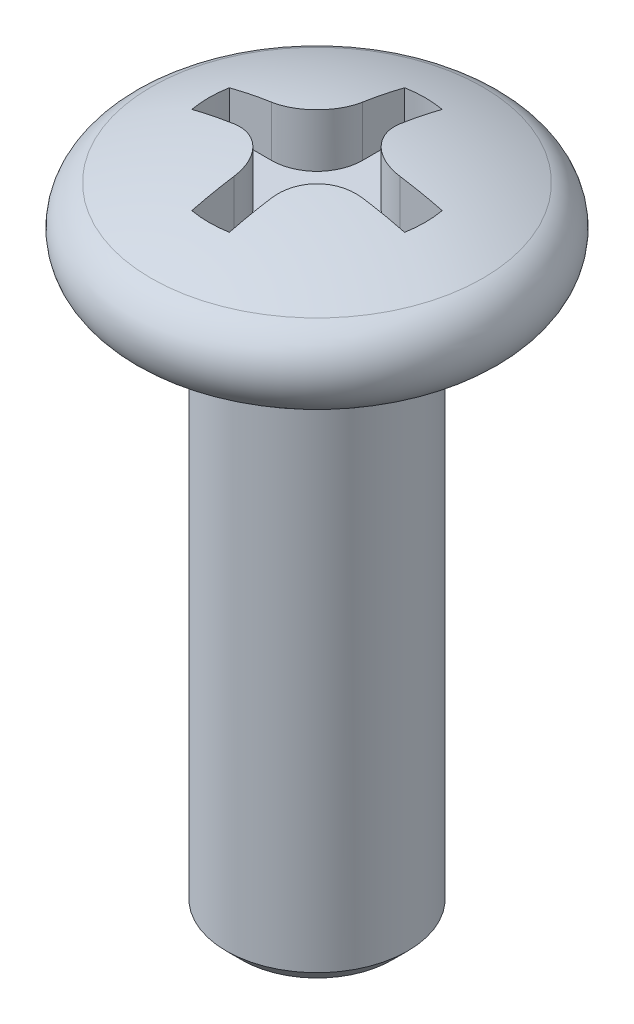
ISO-10303-21;
HEADER;
FILE_DESCRIPTION(('STEP AP214'),'2;1');
FILE_NAME('part.step','',(''),(''),'','','');
FILE_SCHEMA(('AUTOMOTIVE_DESIGN { 1 0 10303 214 1 1 1 1 }'));
ENDSEC;
DATA;
#1=APPLICATION_CONTEXT('core data for automotive mechanical design processes');
#2=APPLICATION_PROTOCOL_DEFINITION('international standard','automotive_design',2000,#1);
#3=PRODUCT_CONTEXT('',#1,'mechanical');
#4=PRODUCT('Part','Part','',(#3));
#5=PRODUCT_RELATED_PRODUCT_CATEGORY('part','',(#4));
#6=PRODUCT_DEFINITION_FORMATION('','',#4);
#7=PRODUCT_DEFINITION_CONTEXT('part definition',#1,'design');
#8=PRODUCT_DEFINITION('design','',#6,#7);
#9=PRODUCT_DEFINITION_SHAPE('','',#8);
#10=(LENGTH_UNIT() NAMED_UNIT(*) SI_UNIT(.MILLI.,.METRE.));
#11=(NAMED_UNIT(*) PLANE_ANGLE_UNIT() SI_UNIT($,.RADIAN.));
#12=(NAMED_UNIT(*) SI_UNIT($,.STERADIAN.) SOLID_ANGLE_UNIT());
#13=UNCERTAINTY_MEASURE_WITH_UNIT(LENGTH_MEASURE(1.E-05),#10,'distance_accuracy_value','');
#14=(GEOMETRIC_REPRESENTATION_CONTEXT(3) GLOBAL_UNCERTAINTY_ASSIGNED_CONTEXT((#13)) GLOBAL_UNIT_ASSIGNED_CONTEXT((#10,
#11,#12)) REPRESENTATION_CONTEXT('',''));
#15=CARTESIAN_POINT('',(0.,0.,0.));
#16=DIRECTION('',(0.,0.,1.));
#17=DIRECTION('',(1.,0.,0.));
#18=AXIS2_PLACEMENT_3D('',#15,#16,#17);
#19=CARTESIAN_POINT('',(0.,0.8,0.));
#20=DIRECTION('',(0.,-1.,0.));
#21=DIRECTION('',(0.,0.,-1.));
#22=AXIS2_PLACEMENT_3D('',#19,#20,#21);
#23=PLANE('',#22);
#24=DIRECTION('',(0.,0.,1.));
#25=VECTOR('',#24,1.);
#26=CARTESIAN_POINT('',(-0.2692388155425,0.8,1.526437178598));
#27=LINE('',#26,#25);
#28=CARTESIAN_POINT('',(-0.2692388155425,0.8,0.9192388155425));
#29=VERTEX_POINT('',#28);
#30=CARTESIAN_POINT('',(-0.2692388155425,0.8,1.52643717859784));
#31=VERTEX_POINT('',#30);
#32=EDGE_CURVE('E159',#29,#31,#27,.T.);
#33=ORIENTED_EDGE('',*,*,#32,.T.);
#34=CARTESIAN_POINT('',(0.,0.8,0.));
#35=DIRECTION('',(0.,-1.,0.));
#36=DIRECTION('',(0.,0.,-1.));
#37=AXIS2_PLACEMENT_3D('',#34,#35,#36);
#38=CIRCLE('',#37,1.55);
#39=CARTESIAN_POINT('',(0.269238815542473,0.8,1.52643717859769));
#40=VERTEX_POINT('',#39);
#41=EDGE_CURVE('E231',#31,#40,#38,.F.);
#42=ORIENTED_EDGE('',*,*,#41,.T.);
#43=DIRECTION('',(0.,0.,-1.));
#44=VECTOR('',#43,1.);
#45=CARTESIAN_POINT('',(0.2692388155425,0.8,0.9192388155425));
#46=LINE('',#45,#44);
#47=CARTESIAN_POINT('',(0.2692388155425,0.8,0.9192388155425));
#48=VERTEX_POINT('',#47);
#49=EDGE_CURVE('E163',#40,#48,#46,.T.);
#50=ORIENTED_EDGE('',*,*,#49,.T.);
#51=CARTESIAN_POINT('',(0.9192388155425,0.8,0.9192388155425));
#52=DIRECTION('',(0.,-1.,0.));
#53=DIRECTION('',(0.,0.,-1.));
#54=AXIS2_PLACEMENT_3D('',#51,#52,#53);
#55=CIRCLE('',#54,0.65);
#56=CARTESIAN_POINT('',(0.9192388155425,0.8,0.2692388155425));
#57=VERTEX_POINT('',#56);
#58=EDGE_CURVE('E166',#57,#48,#55,.F.);
#59=ORIENTED_EDGE('',*,*,#58,.F.);
#60=DIRECTION('',(1.,0.,0.));
#61=VECTOR('',#60,1.);
#62=CARTESIAN_POINT('',(1.526437178598,0.8,0.2692388155425));
#63=LINE('',#62,#61);
#64=CARTESIAN_POINT('',(1.52643717859784,0.8,0.2692388155425));
#65=VERTEX_POINT('',#64);
#66=EDGE_CURVE('E167',#57,#65,#63,.T.);
#67=ORIENTED_EDGE('',*,*,#66,.T.);
#68=CARTESIAN_POINT('',(0.,0.8,0.));
#69=DIRECTION('',(0.,-1.,0.));
#70=DIRECTION('',(0.,0.,-1.));
#71=AXIS2_PLACEMENT_3D('',#68,#69,#70);
#72=CIRCLE('',#71,1.55);
#73=CARTESIAN_POINT('',(1.52643717859769,0.8,-0.269238815542473));
#74=VERTEX_POINT('',#73);
#75=EDGE_CURVE('E242',#65,#74,#72,.F.);
#76=ORIENTED_EDGE('',*,*,#75,.T.);
#77=DIRECTION('',(-1.,0.,0.));
#78=VECTOR('',#77,1.);
#79=CARTESIAN_POINT('',(0.9192388155425,0.8,-0.2692388155425));
#80=LINE('',#79,#78);
#81=CARTESIAN_POINT('',(0.9192388155425,0.8,-0.2692388155425));
#82=VERTEX_POINT('',#81);
#83=EDGE_CURVE('E171',#74,#82,#80,.T.);
#84=ORIENTED_EDGE('',*,*,#83,.T.);
#85=CARTESIAN_POINT('',(0.9192388155425,0.8,-0.9192388155425));
#86=DIRECTION('',(0.,-1.,0.));
#87=DIRECTION('',(0.,0.,-1.));
#88=AXIS2_PLACEMENT_3D('',#85,#86,#87);
#89=CIRCLE('',#88,0.65);
#90=CARTESIAN_POINT('',(0.2692388155425,0.8,-0.9192388155425));
#91=VERTEX_POINT('',#90);
#92=EDGE_CURVE('E174',#91,#82,#89,.F.);
#93=ORIENTED_EDGE('',*,*,#92,.F.);
#94=DIRECTION('',(0.,0.,-1.));
#95=VECTOR('',#94,1.);
#96=CARTESIAN_POINT('',(0.2692388155425,0.8,-1.526437178598));
#97=LINE('',#96,#95);
#98=CARTESIAN_POINT('',(0.2692388155425,0.8,-1.52643717859784));
#99=VERTEX_POINT('',#98);
#100=EDGE_CURVE('E176',#91,#99,#97,.T.);
#101=ORIENTED_EDGE('',*,*,#100,.T.);
#102=CARTESIAN_POINT('',(0.,0.8,0.));
#103=DIRECTION('',(0.,-1.,0.));
#104=DIRECTION('',(0.,0.,-1.));
#105=AXIS2_PLACEMENT_3D('',#102,#103,#104);
#106=CIRCLE('',#105,1.55);
#107=CARTESIAN_POINT('',(-0.269238815542474,0.8,-1.52643717859769));
#108=VERTEX_POINT('',#107);
#109=EDGE_CURVE('E135',#99,#108,#106,.F.);
#110=ORIENTED_EDGE('',*,*,#109,.T.);
#111=DIRECTION('',(0.,0.,1.));
#112=VECTOR('',#111,1.);
#113=CARTESIAN_POINT('',(-0.2692388155425,0.8,-0.9192388155425));
#114=LINE('',#113,#112);
#115=CARTESIAN_POINT('',(-0.2692388155425,0.8,-0.9192388155425));
#116=VERTEX_POINT('',#115);
#117=EDGE_CURVE('E131',#108,#116,#114,.T.);
#118=ORIENTED_EDGE('',*,*,#117,.T.);
#119=CARTESIAN_POINT('',(-0.9192388155425,0.8,-0.9192388155425));
#120=DIRECTION('',(0.,-1.,0.));
#121=DIRECTION('',(0.,0.,-1.));
#122=AXIS2_PLACEMENT_3D('',#119,#120,#121);
#123=CIRCLE('',#122,0.65);
#124=CARTESIAN_POINT('',(-0.9192388155425,0.8,-0.2692388155425));
#125=VERTEX_POINT('',#124);
#126=EDGE_CURVE('E19',#125,#116,#123,.F.);
#127=ORIENTED_EDGE('',*,*,#126,.F.);
#128=DIRECTION('',(-1.,0.,0.));
#129=VECTOR('',#128,1.);
#130=CARTESIAN_POINT('',(-1.526437178598,0.8,-0.2692388155425));
#131=LINE('',#130,#129);
#132=CARTESIAN_POINT('',(-1.52643717859769,0.8,-0.269238815542473));
#133=VERTEX_POINT('',#132);
#134=EDGE_CURVE('E126',#125,#133,#131,.T.);
#135=ORIENTED_EDGE('',*,*,#134,.T.);
#136=CARTESIAN_POINT('',(0.,0.8,0.));
#137=DIRECTION('',(0.,-1.,0.));
#138=DIRECTION('',(0.,0.,-1.));
#139=AXIS2_PLACEMENT_3D('',#136,#137,#138);
#140=CIRCLE('',#139,1.55);
#141=CARTESIAN_POINT('',(-1.52643717859784,0.8,0.2692388155425));
#142=VERTEX_POINT('',#141);
#143=EDGE_CURVE('E239',#133,#142,#140,.F.);
#144=ORIENTED_EDGE('',*,*,#143,.T.);
#145=DIRECTION('',(1.,0.,0.));
#146=VECTOR('',#145,1.);
#147=CARTESIAN_POINT('',(-0.9192388155425,0.8,0.2692388155425));
#148=LINE('',#147,#146);
#149=CARTESIAN_POINT('',(-0.9192388155425,0.8,0.2692388155425));
#150=VERTEX_POINT('',#149);
#151=EDGE_CURVE('E156',#142,#150,#148,.T.);
#152=ORIENTED_EDGE('',*,*,#151,.T.);
#153=CARTESIAN_POINT('',(-0.9192388155425,0.8,0.9192388155425));
#154=DIRECTION('',(0.,-1.,0.));
#155=DIRECTION('',(0.,0.,-1.));
#156=AXIS2_PLACEMENT_3D('',#153,#154,#155);
#157=CIRCLE('',#156,0.65);
#158=EDGE_CURVE('E225',#29,#150,#157,.F.);
#159=ORIENTED_EDGE('',*,*,#158,.F.);
#160=EDGE_LOOP('',(#33,#42,#50,#59,#67,#76,#84,#93,#101,#110,#118,#127,#135,#144,#152,#159));
#161=FACE_BOUND('',#160,.T.);
#162=ADVANCED_FACE('F16',(#161),#23,.F.);
#163=CARTESIAN_POINT('',(-1.526437178598,0.8,-0.2692388155425));
#164=DIRECTION('',(0.,0.,-1.));
#165=DIRECTION('',(-1.,0.,0.));
#166=AXIS2_PLACEMENT_3D('',#163,#164,#165);
#167=PLANE('',#166);
#168=ORIENTED_EDGE('',*,*,#134,.F.);
#169=DIRECTION('',(0.,-1.,0.));
#170=VECTOR('',#169,1.);
#171=CARTESIAN_POINT('',(-0.9192388155425,0.8,-0.2692388155425));
#172=LINE('',#171,#170);
#173=CARTESIAN_POINT('',(-0.919238815542485,1.5247137721749,-0.269238815542501));
#174=VERTEX_POINT('',#173);
#175=EDGE_CURVE('E145',#174,#125,#172,.T.);
#176=ORIENTED_EDGE('',*,*,#175,.F.);
#177=CARTESIAN_POINT('',(-1.52643717859784,1.40083405534686,-0.269238815542502));
#178=CARTESIAN_POINT('',(-1.42628258533272,1.42660341497324,-0.269238815542501));
#179=CARTESIAN_POINT('',(-1.3256054251122,1.44981140452209,-0.2692388155425));
#180=CARTESIAN_POINT('',(-1.12320597076041,1.49110464346474,-0.2692388155425));
#181=CARTESIAN_POINT('',(-1.02148367662913,1.50918989285854,-0.269238815542501));
#182=CARTESIAN_POINT('',(-0.919238815542471,1.52471377217481,-0.269238815542503));
#183=B_SPLINE_CURVE_WITH_KNOTS('',3,(#177,#178,#179,#180,#181,#182),.UNSPECIFIED.,.F.,.F.,(4,2,
4),(0.,0.309952435577939,0.619904871155877),.UNSPECIFIED.);
#184=CARTESIAN_POINT('',(-1.52643717859777,1.40083405534693,-0.269238815542474));
#185=VERTEX_POINT('',#184);
#186=EDGE_CURVE('E222',#185,#174,#183,.T.);
#187=ORIENTED_EDGE('',*,*,#186,.F.);
#188=DIRECTION('',(0.,-1.,0.));
#189=VECTOR('',#188,1.);
#190=CARTESIAN_POINT('',(-1.5264371785977,0.8,-0.269238815542447));
#191=LINE('',#190,#189);
#192=EDGE_CURVE('E237',#185,#133,#191,.T.);
#193=ORIENTED_EDGE('',*,*,#192,.T.);
#194=EDGE_LOOP('',(#168,#176,#187,#193));
#195=FACE_BOUND('',#194,.T.);
#196=ADVANCED_FACE('F280',(#195),#167,.F.);
#197=CARTESIAN_POINT('',(-0.9192388155425,0.8,-0.9192388155425));
#198=DIRECTION('',(0.,-1.,0.));
#199=DIRECTION('',(0.,0.,-1.));
#200=AXIS2_PLACEMENT_3D('',#197,#198,#199);
#201=CYLINDRICAL_SURFACE('',#200,0.65);
#202=DIRECTION('',(0.,1.,0.));
#203=VECTOR('',#202,1.);
#204=CARTESIAN_POINT('',(-0.2692388155425,0.8,-0.9192388155425));
#205=LINE('',#204,#203);
#206=CARTESIAN_POINT('',(-0.269238815542499,1.5247137721749,-0.9192388155425));
#207=VERTEX_POINT('',#206);
#208=EDGE_CURVE('E139',#116,#207,#205,.T.);
#209=ORIENTED_EDGE('',*,*,#208,.T.);
#210=CARTESIAN_POINT('',(-0.919238815542471,1.52471377217481,-0.269238815542502));
#211=CARTESIAN_POINT('',(-0.883271069284547,1.53017838215662,-0.269206596368221));
#212=CARTESIAN_POINT('',(-0.847230957030022,1.53518398680924,-0.272222835690411));
#213=CARTESIAN_POINT('',(-0.776024482266567,1.54415362187526,-0.284194183766013));
#214=CARTESIAN_POINT('',(-0.740857976412674,1.5481178242021,-0.293148311438722));
#215=CARTESIAN_POINT('',(-0.67237147630745,1.55488625546089,-0.316848960302737));
#216=CARTESIAN_POINT('',(-0.639053304502208,1.55768935656103,-0.331601086387425));
#217=CARTESIAN_POINT('',(-0.575297778798748,1.56204492956572,-0.366496760027211));
#218=CARTESIAN_POINT('',(-0.544859240050173,1.56359791783258,-0.386638076978003));
#219=CARTESIAN_POINT('',(-0.488097063461274,1.56539571440067,-0.431479043245953));
#220=CARTESIAN_POINT('',(-0.46172860298219,1.56565593228317,-0.456121349806758));
#221=CARTESIAN_POINT('',(-0.413435525795813,1.56490196217992,-0.509414647326526));
#222=CARTESIAN_POINT('',(-0.391510799474461,1.56388780563375,-0.538065539375813));
#223=CARTESIAN_POINT('',(-0.352825154531402,1.56062536432746,-0.598376464130783));
#224=CARTESIAN_POINT('',(-0.33603703253758,1.55838376285363,-0.630019440211363));
#225=CARTESIAN_POINT('',(-0.307904881496572,1.55273696196925,-0.69554063304805));
#226=CARTESIAN_POINT('',(-0.296559537832556,1.54933204387991,-0.729418307797173));
#227=CARTESIAN_POINT('',(-0.281799832125994,1.54249219211062,-0.789390970708275));
#228=CARTESIAN_POINT('',(-0.277087023520738,1.53929822937966,-0.815202930682549));
#229=CARTESIAN_POINT('',(-0.270805742102409,1.53238664939424,-0.867099473917435));
#230=CARTESIAN_POINT('',(-0.269232761212042,1.52866979112439,-0.893183612184108));
#231=CARTESIAN_POINT('',(-0.269238815542499,1.5247137721748,-0.919238815542471));
#232=B_SPLINE_CURVE_WITH_KNOTS('',3,(#210,#211,#212,#213,#214,#215,#216,#217,#218,#219,#220,
#221,#222,#223,#224,#225,#226,#227,#228,#229,#230,#231),.UNSPECIFIED.,.F.,.F.,(4,2,2,2,2,2,2,2,
2,2,4),(0.,0.109017930799935,0.218017853725243,0.327123406477721,0.436183869743588,
0.543941180487167,0.651695832846214,0.758869525629321,0.866017319256542,0.945129051904781,
1.02412711619082),.UNSPECIFIED.);
#233=EDGE_CURVE('E264',#174,#207,#232,.T.);
#234=ORIENTED_EDGE('',*,*,#233,.F.);
#235=ORIENTED_EDGE('',*,*,#175,.T.);
#236=ORIENTED_EDGE('',*,*,#126,.T.);
#237=EDGE_LOOP('',(#209,#234,#235,#236));
#238=FACE_BOUND('',#237,.T.);
#239=ADVANCED_FACE('F142',(#238),#201,.T.);
#240=CARTESIAN_POINT('',(-0.2692388155425,0.8,-0.9192388155425));
#241=DIRECTION('',(-1.,0.,0.));
#242=DIRECTION('',(0.,0.,1.));
#243=AXIS2_PLACEMENT_3D('',#240,#241,#242);
#244=PLANE('',#243);
#245=ORIENTED_EDGE('',*,*,#117,.F.);
#246=DIRECTION('',(0.,-1.,0.));
#247=VECTOR('',#246,1.);
#248=CARTESIAN_POINT('',(-0.269238815542447,0.8,-1.5264371785977));
#249=LINE('',#248,#247);
#250=CARTESIAN_POINT('',(-0.269238815542499,1.40083405534695,-1.5264371785976));
#251=VERTEX_POINT('',#250);
#252=EDGE_CURVE('E151',#108,#251,#249,.F.);
#253=ORIENTED_EDGE('',*,*,#252,.T.);
#254=CARTESIAN_POINT('',(-0.269238815542499,-4.530985590341,0.));
#255=DIRECTION('',(-1.,0.,0.));
#256=DIRECTION('',(0.,0.,1.));
#257=AXIS2_PLACEMENT_3D('',#254,#255,#256);
#258=CIRCLE('',#257,6.12507100115372);
#259=EDGE_CURVE('E148',#207,#251,#258,.T.);
#260=ORIENTED_EDGE('',*,*,#259,.F.);
#261=ORIENTED_EDGE('',*,*,#208,.F.);
#262=EDGE_LOOP('',(#245,#253,#260,#261));
#263=FACE_BOUND('',#262,.T.);
#264=ADVANCED_FACE('F146',(#263),#244,.F.);
#265=CARTESIAN_POINT('',(0.,0.8,0.));
#266=DIRECTION('',(0.,-1.,0.));
#267=DIRECTION('',(0.,0.,-1.));
#268=AXIS2_PLACEMENT_3D('',#265,#266,#267);
#269=CYLINDRICAL_SURFACE('',#268,1.55);
#270=ORIENTED_EDGE('',*,*,#109,.F.);
#271=DIRECTION('',(0.,1.,0.));
#272=VECTOR('',#271,1.);
#273=CARTESIAN_POINT('',(0.2692388155425,0.8,-1.526437178598));
#274=LINE('',#273,#272);
#275=CARTESIAN_POINT('',(0.2692388155425,1.40083405534691,-1.52643717859775));
#276=VERTEX_POINT('',#275);
#277=EDGE_CURVE('E177',#99,#276,#274,.T.);
#278=ORIENTED_EDGE('',*,*,#277,.T.);
#279=CARTESIAN_POINT('',(0.,1.400834055347,0.));
#280=DIRECTION('',(0.,-1.,0.));
#281=DIRECTION('',(0.,0.,-1.));
#282=AXIS2_PLACEMENT_3D('',#279,#280,#281);
#283=CIRCLE('',#282,1.55);
#284=EDGE_CURVE('E252',#251,#276,#283,.T.);
#285=ORIENTED_EDGE('',*,*,#284,.F.);
#286=ORIENTED_EDGE('',*,*,#252,.F.);
#287=EDGE_LOOP('',(#270,#278,#285,#286));
#288=FACE_BOUND('',#287,.T.);
#289=ADVANCED_FACE('F250',(#288),#269,.F.);
#290=CARTESIAN_POINT('',(0.2692388155425,0.8,-1.526437178598));
#291=DIRECTION('',(1.,0.,0.));
#292=DIRECTION('',(0.,0.,-1.));
#293=AXIS2_PLACEMENT_3D('',#290,#291,#292);
#294=PLANE('',#293);
#295=ORIENTED_EDGE('',*,*,#100,.F.);
#296=DIRECTION('',(0.,-1.,0.));
#297=VECTOR('',#296,1.);
#298=CARTESIAN_POINT('',(0.2692388155425,0.8,-0.9192388155425));
#299=LINE('',#298,#297);
#300=CARTESIAN_POINT('',(0.2692388155425,1.5247137721749,-0.9192388155425));
#301=VERTEX_POINT('',#300);
#302=EDGE_CURVE('E244',#301,#91,#299,.T.);
#303=ORIENTED_EDGE('',*,*,#302,.F.);
#304=CARTESIAN_POINT('',(0.2692388155425,-4.530985590341,0.));
#305=DIRECTION('',(-1.,0.,0.));
#306=DIRECTION('',(0.,0.,1.));
#307=AXIS2_PLACEMENT_3D('',#304,#305,#306);
#308=CIRCLE('',#307,6.12507100115372);
#309=EDGE_CURVE('E255',#276,#301,#308,.F.);
#310=ORIENTED_EDGE('',*,*,#309,.F.);
#311=ORIENTED_EDGE('',*,*,#277,.F.);
#312=EDGE_LOOP('',(#295,#303,#310,#311));
#313=FACE_BOUND('',#312,.T.);
#314=ADVANCED_FACE('F256',(#313),#294,.F.);
#315=CARTESIAN_POINT('',(0.9192388155425,0.8,-0.9192388155425));
#316=DIRECTION('',(0.,-1.,0.));
#317=DIRECTION('',(0.,0.,-1.));
#318=AXIS2_PLACEMENT_3D('',#315,#316,#317);
#319=CYLINDRICAL_SURFACE('',#318,0.65);
#320=DIRECTION('',(0.,1.,0.));
#321=VECTOR('',#320,1.);
#322=CARTESIAN_POINT('',(0.9192388155425,0.8,-0.2692388155425));
#323=LINE('',#322,#321);
#324=CARTESIAN_POINT('',(0.919238815542485,1.5247137721749,-0.269238815542501));
#325=VERTEX_POINT('',#324);
#326=EDGE_CURVE('E173',#82,#325,#323,.T.);
#327=ORIENTED_EDGE('',*,*,#326,.T.);
#328=CARTESIAN_POINT('',(0.2692388155425,1.5247137721748,-0.919238815542471));
#329=CARTESIAN_POINT('',(0.26920659636822,1.53017838215662,-0.883271069284549));
#330=CARTESIAN_POINT('',(0.27222283569041,1.53518398680924,-0.847230957030025));
#331=CARTESIAN_POINT('',(0.284194183766012,1.54415362187526,-0.776024482266574));
#332=CARTESIAN_POINT('',(0.29314831143872,1.5481178242021,-0.740857976412682));
#333=CARTESIAN_POINT('',(0.316848960302734,1.55488625546089,-0.672371476307461));
#334=CARTESIAN_POINT('',(0.33160108638742,1.55768935656103,-0.63905330450222));
#335=CARTESIAN_POINT('',(0.366496760027202,1.56204492956572,-0.575297778798761));
#336=CARTESIAN_POINT('',(0.386638076977991,1.56359791783258,-0.544859240050187));
#337=CARTESIAN_POINT('',(0.431479043245938,1.56539571440067,-0.488097063461288));
#338=CARTESIAN_POINT('',(0.456121349806743,1.56565593228317,-0.461728602982204));
#339=CARTESIAN_POINT('',(0.509414647326511,1.56490196217992,-0.413435525795826));
#340=CARTESIAN_POINT('',(0.538065539375799,1.56388780563376,-0.391510799474473));
#341=CARTESIAN_POINT('',(0.598376464130768,1.56062536432746,-0.352825154531412));
#342=CARTESIAN_POINT('',(0.630019440211347,1.55838376285363,-0.336037032537589));
#343=CARTESIAN_POINT('',(0.695540633048032,1.55273696196925,-0.307904881496577));
#344=CARTESIAN_POINT('',(0.729418307797154,1.54933204387992,-0.296559537832559));
#345=CARTESIAN_POINT('',(0.789390970708259,1.54249219211062,-0.281799832125995));
#346=CARTESIAN_POINT('',(0.815202930682536,1.53929822937967,-0.277087023520739));
#347=CARTESIAN_POINT('',(0.867099473917428,1.53238664939424,-0.270805742102411));
#348=CARTESIAN_POINT('',(0.893183612184104,1.52866979112439,-0.269232761212043));
#349=CARTESIAN_POINT('',(0.91923881554247,1.52471377217481,-0.269238815542501));
#350=B_SPLINE_CURVE_WITH_KNOTS('',3,(#328,#329,#330,#331,#332,#333,#334,#335,#336,#337,#338,
#339,#340,#341,#342,#343,#344,#345,#346,#347,#348,#349),.UNSPECIFIED.,.F.,.F.,(4,2,2,2,2,2,2,2,
2,2,4),(0.,0.10901793079993,0.218017853725233,0.327123406477707,0.436183869743568,
0.543941180487147,0.651695832846195,0.758869525629303,0.866017319256523,0.945129051904771,
1.02412711619082),.UNSPECIFIED.);
#351=EDGE_CURVE('E260',#301,#325,#350,.T.);
#352=ORIENTED_EDGE('',*,*,#351,.F.);
#353=ORIENTED_EDGE('',*,*,#302,.T.);
#354=ORIENTED_EDGE('',*,*,#92,.T.);
#355=EDGE_LOOP('',(#327,#352,#353,#354));
#356=FACE_BOUND('',#355,.T.);
#357=ADVANCED_FACE('F410',(#356),#319,.T.);
#358=CARTESIAN_POINT('',(0.9192388155425,0.8,-0.2692388155425));
#359=DIRECTION('',(0.,0.,-1.));
#360=DIRECTION('',(-1.,0.,0.));
#361=AXIS2_PLACEMENT_3D('',#358,#359,#360);
#362=PLANE('',#361);
#363=ORIENTED_EDGE('',*,*,#83,.F.);
#364=DIRECTION('',(0.,-1.,0.));
#365=VECTOR('',#364,1.);
#366=CARTESIAN_POINT('',(1.5264371785977,0.8,-0.269238815542447));
#367=LINE('',#366,#365);
#368=CARTESIAN_POINT('',(1.52643717859769,1.400834055347,-0.269238815542473));
#369=VERTEX_POINT('',#368);
#370=EDGE_CURVE('E170',#74,#369,#367,.F.);
#371=ORIENTED_EDGE('',*,*,#370,.T.);
#372=CARTESIAN_POINT('',(0.91923881554247,1.52471377217481,-0.269238815542502));
#373=CARTESIAN_POINT('',(1.02148367662913,1.50918989285854,-0.269238815542501));
#374=CARTESIAN_POINT('',(1.12320597076041,1.49110464346474,-0.2692388155425));
#375=CARTESIAN_POINT('',(1.3256054251122,1.44981140452209,-0.2692388155425));
#376=CARTESIAN_POINT('',(1.42628258533272,1.42660341497324,-0.269238815542501));
#377=CARTESIAN_POINT('',(1.52643717859784,1.40083405534686,-0.269238815542503));
#378=B_SPLINE_CURVE_WITH_KNOTS('',3,(#372,#373,#374,#375,#376,#377),.UNSPECIFIED.,.F.,.F.,(4,2,
4),(0.,0.309952435577939,0.619904871155879),.UNSPECIFIED.);
#379=EDGE_CURVE('E505',#325,#369,#378,.T.);
#380=ORIENTED_EDGE('',*,*,#379,.F.);
#381=ORIENTED_EDGE('',*,*,#326,.F.);
#382=EDGE_LOOP('',(#363,#371,#380,#381));
#383=FACE_BOUND('',#382,.T.);
#384=ADVANCED_FACE('F401',(#383),#362,.F.);
#385=CARTESIAN_POINT('',(0.,0.8,0.));
#386=DIRECTION('',(0.,-1.,0.));
#387=DIRECTION('',(0.,0.,-1.));
#388=AXIS2_PLACEMENT_3D('',#385,#386,#387);
#389=CYLINDRICAL_SURFACE('',#388,1.55);
#390=ORIENTED_EDGE('',*,*,#143,.F.);
#391=ORIENTED_EDGE('',*,*,#192,.F.);
#392=CARTESIAN_POINT('',(0.,1.400834055347,0.));
#393=DIRECTION('',(0.,-1.,0.));
#394=DIRECTION('',(0.,0.,-1.));
#395=AXIS2_PLACEMENT_3D('',#392,#393,#394);
#396=CIRCLE('',#395,1.55);
#397=CARTESIAN_POINT('',(-1.52643717859784,1.400834055347,0.2692388155425));
#398=VERTEX_POINT('',#397);
#399=EDGE_CURVE('E511',#398,#185,#396,.T.);
#400=ORIENTED_EDGE('',*,*,#399,.F.);
#401=DIRECTION('',(0.,1.,0.));
#402=VECTOR('',#401,1.);
#403=CARTESIAN_POINT('',(-1.526437178598,0.8,0.2692388155425));
#404=LINE('',#403,#402);
#405=EDGE_CURVE('E158',#398,#142,#404,.F.);
#406=ORIENTED_EDGE('',*,*,#405,.T.);
#407=EDGE_LOOP('',(#390,#391,#400,#406));
#408=FACE_BOUND('',#407,.T.);
#409=ADVANCED_FACE('F392',(#408),#389,.F.);
#410=CARTESIAN_POINT('',(0.,0.8,0.));
#411=DIRECTION('',(0.,-1.,0.));
#412=DIRECTION('',(0.,0.,-1.));
#413=AXIS2_PLACEMENT_3D('',#410,#411,#412);
#414=CYLINDRICAL_SURFACE('',#413,1.55);
#415=ORIENTED_EDGE('',*,*,#370,.F.);
#416=ORIENTED_EDGE('',*,*,#75,.F.);
#417=DIRECTION('',(0.,1.,0.));
#418=VECTOR('',#417,1.);
#419=CARTESIAN_POINT('',(1.526437178598,0.8,0.2692388155425));
#420=LINE('',#419,#418);
#421=CARTESIAN_POINT('',(1.52643717859795,1.40083405534692,0.269238815542498));
#422=VERTEX_POINT('',#421);
#423=EDGE_CURVE('E169',#65,#422,#420,.T.);
#424=ORIENTED_EDGE('',*,*,#423,.T.);
#425=CARTESIAN_POINT('',(0.,1.400834055347,0.));
#426=DIRECTION('',(0.,-1.,0.));
#427=DIRECTION('',(0.,0.,-1.));
#428=AXIS2_PLACEMENT_3D('',#425,#426,#427);
#429=CIRCLE('',#428,1.55);
#430=EDGE_CURVE('E513',#369,#422,#429,.T.);
#431=ORIENTED_EDGE('',*,*,#430,.F.);
#432=EDGE_LOOP('',(#415,#416,#424,#431));
#433=FACE_BOUND('',#432,.T.);
#434=ADVANCED_FACE('F383',(#433),#414,.F.);
#435=CARTESIAN_POINT('',(1.526437178598,0.8,0.2692388155425));
#436=DIRECTION('',(0.,0.,1.));
#437=DIRECTION('',(1.,0.,0.));
#438=AXIS2_PLACEMENT_3D('',#435,#436,#437);
#439=PLANE('',#438);
#440=ORIENTED_EDGE('',*,*,#66,.F.);
#441=DIRECTION('',(0.,-1.,0.));
#442=VECTOR('',#441,1.);
#443=CARTESIAN_POINT('',(0.9192388155425,0.8,0.2692388155425));
#444=LINE('',#443,#442);
#445=CARTESIAN_POINT('',(0.919238815542485,1.5247137721749,0.269238815542499));
#446=VERTEX_POINT('',#445);
#447=EDGE_CURVE('E233',#446,#57,#444,.T.);
#448=ORIENTED_EDGE('',*,*,#447,.F.);
#449=CARTESIAN_POINT('',(1.5264371785979,1.40083405534685,0.269238815542497));
#450=CARTESIAN_POINT('',(1.42628258533276,1.42660341497323,0.269238815542499));
#451=CARTESIAN_POINT('',(1.32560542511224,1.44981140452209,0.2692388155425));
#452=CARTESIAN_POINT('',(1.12320597076043,1.49110464346474,0.2692388155425));
#453=CARTESIAN_POINT('',(1.02148367662914,1.50918989285854,0.269238815542499));
#454=CARTESIAN_POINT('',(0.91923881554247,1.52471377217481,0.269238815542498));
#455=B_SPLINE_CURVE_WITH_KNOTS('',3,(#449,#450,#451,#452,#453,#454),.UNSPECIFIED.,.F.,.F.,(4,2,
4),(0.,0.309952435577969,0.619904871155937),.UNSPECIFIED.);
#456=EDGE_CURVE('E515',#422,#446,#455,.T.);
#457=ORIENTED_EDGE('',*,*,#456,.F.);
#458=ORIENTED_EDGE('',*,*,#423,.F.);
#459=EDGE_LOOP('',(#440,#448,#457,#458));
#460=FACE_BOUND('',#459,.T.);
#461=ADVANCED_FACE('F374',(#460),#439,.F.);
#462=CARTESIAN_POINT('',(0.9192388155425,0.8,0.9192388155425));
#463=DIRECTION('',(0.,-1.,0.));
#464=DIRECTION('',(0.,0.,-1.));
#465=AXIS2_PLACEMENT_3D('',#462,#463,#464);
#466=CYLINDRICAL_SURFACE('',#465,0.65);
#467=DIRECTION('',(0.,1.,0.));
#468=VECTOR('',#467,1.);
#469=CARTESIAN_POINT('',(0.2692388155425,0.8,0.9192388155425));
#470=LINE('',#469,#468);
#471=CARTESIAN_POINT('',(0.2692388155425,1.5247137721749,0.9192388155425));
#472=VERTEX_POINT('',#471);
#473=EDGE_CURVE('E165',#48,#472,#470,.T.);
#474=ORIENTED_EDGE('',*,*,#473,.T.);
#475=CARTESIAN_POINT('',(0.91923881554247,1.52471377217481,0.269238815542498));
#476=CARTESIAN_POINT('',(0.883271069284547,1.53017838215662,0.269206596368219));
#477=CARTESIAN_POINT('',(0.847230957030021,1.53518398680924,0.27222283569041));
#478=CARTESIAN_POINT('',(0.776024482266567,1.54415362187526,0.284194183766014));
#479=CARTESIAN_POINT('',(0.740857976412673,1.5481178242021,0.293148311438724));
#480=CARTESIAN_POINT('',(0.67237147630745,1.55488625546089,0.316848960302739));
#481=CARTESIAN_POINT('',(0.639053304502207,1.55768935656103,0.331601086387426));
#482=CARTESIAN_POINT('',(0.575297778798747,1.56204492956572,0.36649676002721));
#483=CARTESIAN_POINT('',(0.544859240050172,1.56359791783258,0.386638076978001));
#484=CARTESIAN_POINT('',(0.488097063461273,1.56539571440067,0.43147904324595));
#485=CARTESIAN_POINT('',(0.461728602982189,1.56565593228317,0.456121349806757));
#486=CARTESIAN_POINT('',(0.413435525795813,1.56490196217992,0.509414647326527));
#487=CARTESIAN_POINT('',(0.39151079947446,1.56388780563376,0.538065539375815));
#488=CARTESIAN_POINT('',(0.352825154531401,1.56062536432746,0.598376464130786));
#489=CARTESIAN_POINT('',(0.336037032537579,1.55838376285363,0.630019440211365));
#490=CARTESIAN_POINT('',(0.307904881496571,1.55273696196925,0.695540633048051));
#491=CARTESIAN_POINT('',(0.296559537832556,1.54933204387991,0.729418307797174));
#492=CARTESIAN_POINT('',(0.281799832125994,1.54249219211062,0.789390970708276));
#493=CARTESIAN_POINT('',(0.277087023520738,1.53929822937966,0.815202930682551));
#494=CARTESIAN_POINT('',(0.270805742102409,1.53238664939424,0.867099473917437));
#495=CARTESIAN_POINT('',(0.269232761212041,1.52866979112439,0.89318361218411));
#496=CARTESIAN_POINT('',(0.2692388155425,1.5247137721748,0.919238815542473));
#497=B_SPLINE_CURVE_WITH_KNOTS('',3,(#475,#476,#477,#478,#479,#480,#481,#482,#483,#484,#485,
#486,#487,#488,#489,#490,#491,#492,#493,#494,#495,#496),.UNSPECIFIED.,.F.,.F.,(4,2,2,2,2,2,2,2,
2,2,4),(0.,0.109017930799935,0.218017853725244,0.327123406477721,0.436183869743587,
0.543941180487167,0.651695832846216,0.758869525629322,0.866017319256542,0.945129051904782,
1.02412711619082),.UNSPECIFIED.);
#498=EDGE_CURVE('E521',#446,#472,#497,.T.);
#499=ORIENTED_EDGE('',*,*,#498,.F.);
#500=ORIENTED_EDGE('',*,*,#447,.T.);
#501=ORIENTED_EDGE('',*,*,#58,.T.);
#502=EDGE_LOOP('',(#474,#499,#500,#501));
#503=FACE_BOUND('',#502,.T.);
#504=ADVANCED_FACE('F365',(#503),#466,.T.);
#505=CARTESIAN_POINT('',(0.2692388155425,0.8,0.9192388155425));
#506=DIRECTION('',(1.,0.,0.));
#507=DIRECTION('',(0.,0.,-1.));
#508=AXIS2_PLACEMENT_3D('',#505,#506,#507);
#509=PLANE('',#508);
#510=ORIENTED_EDGE('',*,*,#49,.F.);
#511=DIRECTION('',(0.,-1.,0.));
#512=VECTOR('',#511,1.);
#513=CARTESIAN_POINT('',(0.269238815542447,0.8,1.5264371785977));
#514=LINE('',#513,#512);
#515=CARTESIAN_POINT('',(0.2692388155425,1.40083405534695,1.5264371785976));
#516=VERTEX_POINT('',#515);
#517=EDGE_CURVE('E162',#40,#516,#514,.F.);
#518=ORIENTED_EDGE('',*,*,#517,.T.);
#519=CARTESIAN_POINT('',(0.2692388155425,-4.530985590341,0.));
#520=DIRECTION('',(-1.,0.,0.));
#521=DIRECTION('',(0.,0.,1.));
#522=AXIS2_PLACEMENT_3D('',#519,#520,#521);
#523=CIRCLE('',#522,6.12507100115372);
#524=EDGE_CURVE('E530',#472,#516,#523,.F.);
#525=ORIENTED_EDGE('',*,*,#524,.F.);
#526=ORIENTED_EDGE('',*,*,#473,.F.);
#527=EDGE_LOOP('',(#510,#518,#525,#526));
#528=FACE_BOUND('',#527,.T.);
#529=ADVANCED_FACE('F356',(#528),#509,.F.);
#530=CARTESIAN_POINT('',(0.,0.8,0.));
#531=DIRECTION('',(0.,-1.,0.));
#532=DIRECTION('',(0.,0.,-1.));
#533=AXIS2_PLACEMENT_3D('',#530,#531,#532);
#534=CYLINDRICAL_SURFACE('',#533,1.55);
#535=ORIENTED_EDGE('',*,*,#41,.F.);
#536=DIRECTION('',(0.,1.,0.));
#537=VECTOR('',#536,1.);
#538=CARTESIAN_POINT('',(-0.2692388155425,0.8,1.526437178598));
#539=LINE('',#538,#537);
#540=CARTESIAN_POINT('',(-0.269238815542499,1.40083405534691,1.52643717859775));
#541=VERTEX_POINT('',#540);
#542=EDGE_CURVE('E161',#31,#541,#539,.T.);
#543=ORIENTED_EDGE('',*,*,#542,.T.);
#544=CARTESIAN_POINT('',(0.,1.400834055347,0.));
#545=DIRECTION('',(0.,-1.,0.));
#546=DIRECTION('',(0.,0.,-1.));
#547=AXIS2_PLACEMENT_3D('',#544,#545,#546);
#548=CIRCLE('',#547,1.55);
#549=EDGE_CURVE('E533',#516,#541,#548,.T.);
#550=ORIENTED_EDGE('',*,*,#549,.F.);
#551=ORIENTED_EDGE('',*,*,#517,.F.);
#552=EDGE_LOOP('',(#535,#543,#550,#551));
#553=FACE_BOUND('',#552,.T.);
#554=ADVANCED_FACE('F347',(#553),#534,.F.);
#555=CARTESIAN_POINT('',(-0.2692388155425,0.8,1.526437178598));
#556=DIRECTION('',(-1.,0.,0.));
#557=DIRECTION('',(0.,0.,1.));
#558=AXIS2_PLACEMENT_3D('',#555,#556,#557);
#559=PLANE('',#558);
#560=ORIENTED_EDGE('',*,*,#32,.F.);
#561=DIRECTION('',(0.,-1.,0.));
#562=VECTOR('',#561,1.);
#563=CARTESIAN_POINT('',(-0.2692388155425,0.8,0.9192388155425));
#564=LINE('',#563,#562);
#565=CARTESIAN_POINT('',(-0.269238815542499,1.5247137721749,0.9192388155425));
#566=VERTEX_POINT('',#565);
#567=EDGE_CURVE('E226',#566,#29,#564,.T.);
#568=ORIENTED_EDGE('',*,*,#567,.F.);
#569=CARTESIAN_POINT('',(-0.269238815542499,-4.530985590341,0.));
#570=DIRECTION('',(-1.,0.,0.));
#571=DIRECTION('',(0.,0.,1.));
#572=AXIS2_PLACEMENT_3D('',#569,#570,#571);
#573=CIRCLE('',#572,6.12507100115372);
#574=EDGE_CURVE('E535',#541,#566,#573,.T.);
#575=ORIENTED_EDGE('',*,*,#574,.F.);
#576=ORIENTED_EDGE('',*,*,#542,.F.);
#577=EDGE_LOOP('',(#560,#568,#575,#576));
#578=FACE_BOUND('',#577,.T.);
#579=ADVANCED_FACE('F340',(#578),#559,.F.);
#580=CARTESIAN_POINT('',(-0.9192388155425,0.8,0.9192388155425));
#581=DIRECTION('',(0.,-1.,0.));
#582=DIRECTION('',(0.,0.,-1.));
#583=AXIS2_PLACEMENT_3D('',#580,#581,#582);
#584=CYLINDRICAL_SURFACE('',#583,0.65);
#585=DIRECTION('',(0.,1.,0.));
#586=VECTOR('',#585,1.);
#587=CARTESIAN_POINT('',(-0.9192388155425,0.8,0.2692388155425));
#588=LINE('',#587,#586);
#589=CARTESIAN_POINT('',(-0.919238815542485,1.5247137721749,0.269238815542499));
#590=VERTEX_POINT('',#589);
#591=EDGE_CURVE('E34',#150,#590,#588,.T.);
#592=ORIENTED_EDGE('',*,*,#591,.T.);
#593=CARTESIAN_POINT('',(-0.269238815542499,1.5247137721748,0.919238815542473));
#594=CARTESIAN_POINT('',(-0.26920659636822,1.53017838215662,0.883271069284551));
#595=CARTESIAN_POINT('',(-0.27222283569041,1.53518398680924,0.847230957030028));
#596=CARTESIAN_POINT('',(-0.284194183766012,1.54415362187526,0.776024482266576));
#597=CARTESIAN_POINT('',(-0.29314831143872,1.5481178242021,0.740857976412684));
#598=CARTESIAN_POINT('',(-0.316848960302733,1.55488625546089,0.672371476307463));
#599=CARTESIAN_POINT('',(-0.331601086387419,1.55768935656103,0.639053304502222));
#600=CARTESIAN_POINT('',(-0.3664967600272,1.56204492956572,0.575297778798763));
#601=CARTESIAN_POINT('',(-0.386638076977989,1.56359791783258,0.544859240050189));
#602=CARTESIAN_POINT('',(-0.431479043245935,1.56539571440067,0.488097063461289));
#603=CARTESIAN_POINT('',(-0.45612134980674,1.56565593228317,0.461728602982205));
#604=CARTESIAN_POINT('',(-0.509414647326509,1.56490196217992,0.413435525795828));
#605=CARTESIAN_POINT('',(-0.538065539375797,1.56388780563376,0.391510799474476));
#606=CARTESIAN_POINT('',(-0.598376464130766,1.56062536432746,0.352825154531415));
#607=CARTESIAN_POINT('',(-0.630019440211344,1.55838376285363,0.33603703253759));
#608=CARTESIAN_POINT('',(-0.695540633048029,1.55273696196925,0.307904881496579));
#609=CARTESIAN_POINT('',(-0.729418307797152,1.54933204387992,0.296559537832563));
#610=CARTESIAN_POINT('',(-0.789390970708258,1.54249219211062,0.281799832125998));
#611=CARTESIAN_POINT('',(-0.815202930682535,1.53929822937967,0.27708702352074));
#612=CARTESIAN_POINT('',(-0.867099473917428,1.53238664939424,0.270805742102409));
#613=CARTESIAN_POINT('',(-0.893183612184104,1.52866979112439,0.269232761212041));
#614=CARTESIAN_POINT('',(-0.919238815542471,1.52471377217481,0.269238815542499));
#615=B_SPLINE_CURVE_WITH_KNOTS('',3,(#593,#594,#595,#596,#597,#598,#599,#600,#601,#602,#603,
#604,#605,#606,#607,#608,#609,#610,#611,#612,#613,#614),.UNSPECIFIED.,.F.,.F.,(4,2,2,2,2,2,2,2,
2,2,4),(0.,0.10901793079993,0.218017853725234,0.327123406477707,0.436183869743568,
0.543941180487147,0.651695832846194,0.758869525629302,0.866017319256523,0.945129051904773,
1.02412711619082),.UNSPECIFIED.);
#616=EDGE_CURVE('E198',#566,#590,#615,.T.);
#617=ORIENTED_EDGE('',*,*,#616,.F.);
#618=ORIENTED_EDGE('',*,*,#567,.T.);
#619=ORIENTED_EDGE('',*,*,#158,.T.);
#620=EDGE_LOOP('',(#592,#617,#618,#619));
#621=FACE_BOUND('',#620,.T.);
#622=ADVANCED_FACE('F332',(#621),#584,.T.);
#623=CARTESIAN_POINT('',(-0.9192388155425,0.8,0.2692388155425));
#624=DIRECTION('',(0.,0.,1.));
#625=DIRECTION('',(1.,0.,0.));
#626=AXIS2_PLACEMENT_3D('',#623,#624,#625);
#627=PLANE('',#626);
#628=ORIENTED_EDGE('',*,*,#151,.F.);
#629=ORIENTED_EDGE('',*,*,#405,.F.);
#630=CARTESIAN_POINT('',(-0.919238815542471,1.52471377217481,0.269238815542498));
#631=CARTESIAN_POINT('',(-1.02148367662914,1.50918989285854,0.2692388155425));
#632=CARTESIAN_POINT('',(-1.12320597076043,1.49110464346474,0.2692388155425));
#633=CARTESIAN_POINT('',(-1.32560542511224,1.44981140452209,0.2692388155425));
#634=CARTESIAN_POINT('',(-1.42628258533276,1.42660341497323,0.269238815542498));
#635=CARTESIAN_POINT('',(-1.5264371785979,1.40083405534685,0.269238815542496));
#636=B_SPLINE_CURVE_WITH_KNOTS('',3,(#630,#631,#632,#633,#634,#635),.UNSPECIFIED.,.F.,.F.,(4,2,
4),(0.,0.309952435577968,0.619904871155936),.UNSPECIFIED.);
#637=EDGE_CURVE('E190',#590,#398,#636,.T.);
#638=ORIENTED_EDGE('',*,*,#637,.F.);
#639=ORIENTED_EDGE('',*,*,#591,.F.);
#640=EDGE_LOOP('',(#628,#629,#638,#639));
#641=FACE_BOUND('',#640,.T.);
#642=ADVANCED_FACE('F204',(#641),#627,.F.);
#643=CARTESIAN_POINT('',(0.,-4.530985590341,0.));
#644=DIRECTION('',(-1.,0.,0.));
#645=DIRECTION('',(0.,0.,-1.));
#646=AXIS2_PLACEMENT_3D('',#643,#644,#645);
#647=SPHERICAL_SURFACE('',#646,6.130985590341);
#648=CARTESIAN_POINT('',(0.,1.12000000000007,0.));
#649=DIRECTION('',(0.,-1.,0.));
#650=DIRECTION('',(-1.,0.,0.));
#651=AXIS2_PLACEMENT_3D('',#648,#649,#650);
#652=CIRCLE('',#651,2.37809717352503);
#653=CARTESIAN_POINT('',(-2.37809717352503,1.12000000000007,0.));
#654=VERTEX_POINT('',#653);
#655=EDGE_CURVE('E187',#654,#654,#652,.T.);
#656=ORIENTED_EDGE('',*,*,#655,.F.);
#657=EDGE_LOOP('',(#656));
#658=FACE_BOUND('',#657,.T.);
#659=ORIENTED_EDGE('',*,*,#616,.T.);
#660=ORIENTED_EDGE('',*,*,#637,.T.);
#661=ORIENTED_EDGE('',*,*,#399,.T.);
#662=ORIENTED_EDGE('',*,*,#186,.T.);
#663=ORIENTED_EDGE('',*,*,#233,.T.);
#664=ORIENTED_EDGE('',*,*,#259,.T.);
#665=ORIENTED_EDGE('',*,*,#284,.T.);
#666=ORIENTED_EDGE('',*,*,#309,.T.);
#667=ORIENTED_EDGE('',*,*,#351,.T.);
#668=ORIENTED_EDGE('',*,*,#379,.T.);
#669=ORIENTED_EDGE('',*,*,#430,.T.);
#670=ORIENTED_EDGE('',*,*,#456,.T.);
#671=ORIENTED_EDGE('',*,*,#498,.T.);
#672=ORIENTED_EDGE('',*,*,#524,.T.);
#673=ORIENTED_EDGE('',*,*,#549,.T.);
#674=ORIENTED_EDGE('',*,*,#574,.T.);
#675=EDGE_LOOP('',(#659,#660,#661,#662,#663,#664,#665,#666,#667,#668,#669,#670,#671,#672,#673,#674));
#676=FACE_BOUND('',#675,.T.);
#677=ADVANCED_FACE('F206',(#658,#676),#647,.T.);
#678=CARTESIAN_POINT('',(0.,0.56,0.));
#679=DIRECTION('',(0.,-1.,0.));
#680=DIRECTION('',(-1.,0.,0.));
#681=AXIS2_PLACEMENT_3D('',#678,#679,#680);
#682=TOROIDAL_SURFACE('',#681,2.142433076372,0.6075669236282);
#683=CARTESIAN_POINT('',(0.,0.,0.));
#684=DIRECTION('',(0.,-1.,0.));
#685=DIRECTION('',(0.,0.,-1.));
#686=AXIS2_PLACEMENT_3D('',#683,#684,#685);
#687=CIRCLE('',#686,2.3780971735252);
#688=CARTESIAN_POINT('',(0.,0.,-2.3780971735252));
#689=VERTEX_POINT('',#688);
#690=EDGE_CURVE('E184',#689,#689,#687,.T.);
#691=ORIENTED_EDGE('',*,*,#690,.F.);
#692=EDGE_LOOP('',(#691));
#693=FACE_BOUND('',#692,.T.);
#694=ORIENTED_EDGE('',*,*,#655,.T.);
#695=EDGE_LOOP('',(#694));
#696=FACE_BOUND('',#695,.T.);
#697=ADVANCED_FACE('F211',(#693,#696),#682,.T.);
#698=CARTESIAN_POINT('',(0.,-8.,0.));
#699=DIRECTION('',(0.,-1.,0.));
#700=DIRECTION('',(0.,0.,-1.));
#701=AXIS2_PLACEMENT_3D('',#698,#699,#700);
#702=PLANE('',#701);
#703=CARTESIAN_POINT('',(0.,-7.99999999998136,0.));
#704=DIRECTION('',(0.,1.,0.));
#705=DIRECTION('',(0.,0.,1.));
#706=AXIS2_PLACEMENT_3D('',#703,#704,#705);
#707=CIRCLE('',#706,1.07500000001437);
#708=CARTESIAN_POINT('',(0.,-7.99999999998136,1.07500000001437));
#709=VERTEX_POINT('',#708);
#710=EDGE_CURVE('E181',#709,#709,#707,.T.);
#711=ORIENTED_EDGE('',*,*,#710,.F.);
#712=EDGE_LOOP('',(#711));
#713=FACE_BOUND('',#712,.T.);
#714=ADVANCED_FACE('F302',(#713),#702,.T.);
#715=CARTESIAN_POINT('',(0.,0.,0.));
#716=DIRECTION('',(0.,-1.,0.));
#717=DIRECTION('',(0.,0.,-1.));
#718=AXIS2_PLACEMENT_3D('',#715,#716,#717);
#719=PLANE('',#718);
#720=CARTESIAN_POINT('',(0.,0.,0.));
#721=DIRECTION('',(0.,-1.,0.));
#722=DIRECTION('',(0.,0.,-1.));
#723=AXIS2_PLACEMENT_3D('',#720,#721,#722);
#724=CIRCLE('',#723,1.3);
#725=CARTESIAN_POINT('',(0.,0.,-1.3));
#726=VERTEX_POINT('',#725);
#727=EDGE_CURVE('E25',#726,#726,#724,.T.);
#728=ORIENTED_EDGE('',*,*,#727,.F.);
#729=EDGE_LOOP('',(#728));
#730=FACE_BOUND('',#729,.T.);
#731=ORIENTED_EDGE('',*,*,#690,.T.);
#732=EDGE_LOOP('',(#731));
#733=FACE_BOUND('',#732,.T.);
#734=ADVANCED_FACE('F296',(#730,#733),#719,.T.);
#735=CARTESIAN_POINT('',(0.,-7.77499999998099,0.));
#736=DIRECTION('',(0.,1.,0.));
#737=DIRECTION('',(0.,0.,1.));
#738=AXIS2_PLACEMENT_3D('',#735,#736,#737);
#739=CONICAL_SURFACE('',#738,1.30000000001473,0.785398163397448);
#740=CARTESIAN_POINT('',(0.,-7.775,0.));
#741=DIRECTION('',(0.,-1.,0.));
#742=DIRECTION('',(0.,0.,-1.));
#743=AXIS2_PLACEMENT_3D('',#740,#741,#742);
#744=CIRCLE('',#743,1.3);
#745=CARTESIAN_POINT('',(0.,-7.775,-1.3));
#746=VERTEX_POINT('',#745);
#747=EDGE_CURVE('E11',#746,#746,#744,.F.);
#748=ORIENTED_EDGE('',*,*,#747,.F.);
#749=EDGE_LOOP('',(#748));
#750=FACE_BOUND('',#749,.T.);
#751=ORIENTED_EDGE('',*,*,#710,.T.);
#752=EDGE_LOOP('',(#751));
#753=FACE_BOUND('',#752,.T.);
#754=ADVANCED_FACE('F290',(#750,#753),#739,.T.);
#755=CARTESIAN_POINT('',(0.,2.08,0.));
#756=DIRECTION('',(0.,-1.,0.));
#757=DIRECTION('',(0.,0.,-1.));
#758=AXIS2_PLACEMENT_3D('',#755,#756,#757);
#759=CYLINDRICAL_SURFACE('',#758,1.3);
#760=ORIENTED_EDGE('',*,*,#727,.T.);
#761=EDGE_LOOP('',(#760));
#762=FACE_BOUND('',#761,.T.);
#763=ORIENTED_EDGE('',*,*,#747,.T.);
#764=EDGE_LOOP('',(#763));
#765=FACE_BOUND('',#764,.T.);
#766=ADVANCED_FACE('F288',(#762,#765),#759,.T.);
#767=CLOSED_SHELL('',(#162,#196,#239,#264,#289,#314,#357,#384,#409,#434,#461,#504,#529,#554,
#579,#622,#642,#677,#697,#714,#734,#754,#766));
#768=MANIFOLD_SOLID_BREP('B1',#767);
#769=ADVANCED_BREP_SHAPE_REPRESENTATION('',(#18,#768),#14);
#770=SHAPE_DEFINITION_REPRESENTATION(#9,#769);
ENDSEC;
END-ISO-10303-21;
